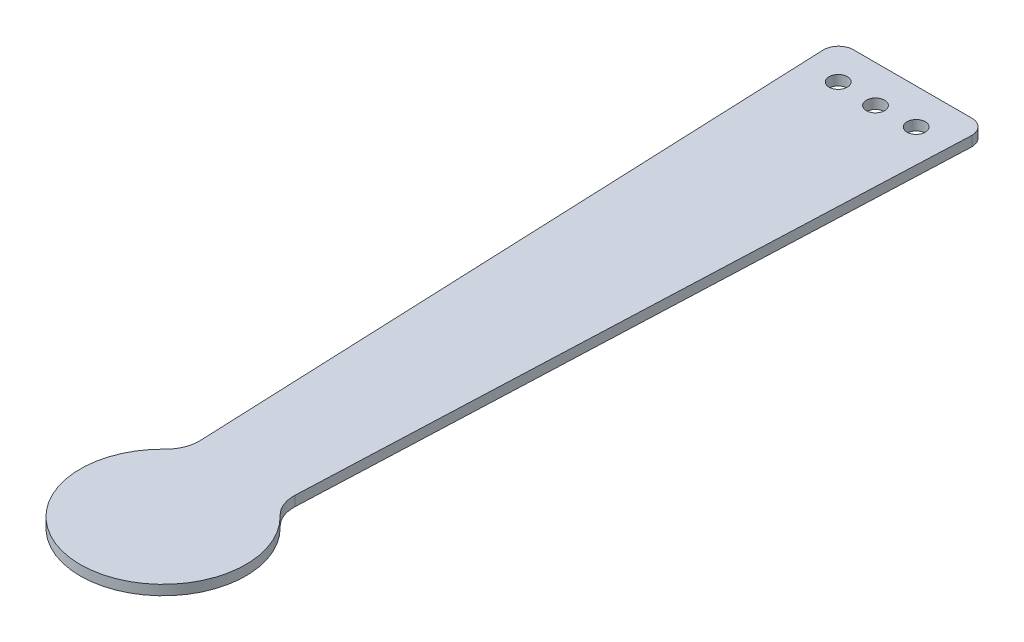
ISO-10303-21;
HEADER;
FILE_DESCRIPTION(('STEP AP214'),'2;1');
FILE_NAME('part.step','',(''),(''),'','','');
FILE_SCHEMA(('AUTOMOTIVE_DESIGN { 1 0 10303 214 1 1 1 1 }'));
ENDSEC;
DATA;
#1=APPLICATION_CONTEXT('core data for automotive mechanical design processes');
#2=APPLICATION_PROTOCOL_DEFINITION('international standard','automotive_design',2000,#1);
#3=PRODUCT_CONTEXT('',#1,'mechanical');
#4=PRODUCT('Part','Part','',(#3));
#5=PRODUCT_RELATED_PRODUCT_CATEGORY('part','',(#4));
#6=PRODUCT_DEFINITION_FORMATION('','',#4);
#7=PRODUCT_DEFINITION_CONTEXT('part definition',#1,'design');
#8=PRODUCT_DEFINITION('design','',#6,#7);
#9=PRODUCT_DEFINITION_SHAPE('','',#8);
#10=(LENGTH_UNIT() NAMED_UNIT(*) SI_UNIT(.MILLI.,.METRE.));
#11=(NAMED_UNIT(*) PLANE_ANGLE_UNIT() SI_UNIT($,.RADIAN.));
#12=(NAMED_UNIT(*) SI_UNIT($,.STERADIAN.) SOLID_ANGLE_UNIT());
#13=UNCERTAINTY_MEASURE_WITH_UNIT(LENGTH_MEASURE(1.E-05),#10,'distance_accuracy_value','');
#14=(GEOMETRIC_REPRESENTATION_CONTEXT(3) GLOBAL_UNCERTAINTY_ASSIGNED_CONTEXT((#13)) GLOBAL_UNIT_ASSIGNED_CONTEXT((#10,
#11,#12)) REPRESENTATION_CONTEXT('',''));
#15=CARTESIAN_POINT('',(0.,0.,0.));
#16=DIRECTION('',(0.,0.,1.));
#17=DIRECTION('',(1.,0.,0.));
#18=AXIS2_PLACEMENT_3D('',#15,#16,#17);
#19=CARTESIAN_POINT('',(0.,3.,0.));
#20=DIRECTION('',(0.,0.,-1.));
#21=DIRECTION('',(-1.,0.,0.));
#22=AXIS2_PLACEMENT_3D('',#19,#20,#21);
#23=PLANE('',#22);
#24=DIRECTION('',(1.,0.,0.));
#25=VECTOR('',#24,1.);
#26=CARTESIAN_POINT('',(0.,0.,0.));
#27=LINE('',#26,#25);
#28=CARTESIAN_POINT('',(-18.1651658032971,0.,0.));
#29=VERTEX_POINT('',#28);
#30=CARTESIAN_POINT('',(18.1651658032971,0.,0.));
#31=VERTEX_POINT('',#30);
#32=EDGE_CURVE('E137',#29,#31,#27,.T.);
#33=ORIENTED_EDGE('',*,*,#32,.F.);
#34=DIRECTION('',(0.,-1.,0.));
#35=VECTOR('',#34,1.);
#36=CARTESIAN_POINT('',(-18.1651658032971,3.,0.));
#37=LINE('',#36,#35);
#38=CARTESIAN_POINT('',(-18.1651658032971,3.,0.));
#39=VERTEX_POINT('',#38);
#40=EDGE_CURVE('E11',#39,#29,#37,.T.);
#41=ORIENTED_EDGE('',*,*,#40,.F.);
#42=DIRECTION('',(1.,0.,0.));
#43=VECTOR('',#42,1.);
#44=CARTESIAN_POINT('',(0.,3.,0.));
#45=LINE('',#44,#43);
#46=CARTESIAN_POINT('',(18.1651658032971,3.,0.));
#47=VERTEX_POINT('',#46);
#48=EDGE_CURVE('E315',#39,#47,#45,.T.);
#49=ORIENTED_EDGE('',*,*,#48,.T.);
#50=DIRECTION('',(0.,-1.,0.));
#51=VECTOR('',#50,1.);
#52=CARTESIAN_POINT('',(18.1651658032971,3.,0.));
#53=LINE('',#52,#51);
#54=EDGE_CURVE('E51',#47,#31,#53,.T.);
#55=ORIENTED_EDGE('',*,*,#54,.T.);
#56=EDGE_LOOP('',(#33,#41,#49,#55));
#57=FACE_BOUND('',#56,.T.);
#58=ADVANCED_FACE('F34',(#57),#23,.T.);
#59=CARTESIAN_POINT('',(-17.8359122712119,3.,4.52844895976158));
#60=DIRECTION('',(0.,-1.,0.));
#61=DIRECTION('',(0.,0.,-1.));
#62=AXIS2_PLACEMENT_3D('',#59,#60,#61);
#63=CYLINDRICAL_SURFACE('',#62,4.54040283119861);
#64=CARTESIAN_POINT('',(-17.8359122712119,0.,4.52844895976158));
#65=DIRECTION('',(0.,1.,0.));
#66=DIRECTION('',(0.,0.,1.));
#67=AXIS2_PLACEMENT_3D('',#64,#65,#66);
#68=CIRCLE('',#67,4.54040283119861);
#69=CARTESIAN_POINT('',(-22.3761927820387,0.,4.49512100508649));
#70=VERTEX_POINT('',#69);
#71=EDGE_CURVE('E139',#29,#70,#68,.T.);
#72=ORIENTED_EDGE('',*,*,#71,.T.);
#73=DIRECTION('',(0.,-1.,0.));
#74=VECTOR('',#73,1.);
#75=CARTESIAN_POINT('',(-22.3761927820387,3.,4.49512100508649));
#76=LINE('',#75,#74);
#77=CARTESIAN_POINT('',(-22.3761927820387,3.,4.49512100508649));
#78=VERTEX_POINT('',#77);
#79=EDGE_CURVE('E43',#78,#70,#76,.T.);
#80=ORIENTED_EDGE('',*,*,#79,.F.);
#81=CARTESIAN_POINT('',(-17.8359122712119,3.,4.52844895976158));
#82=DIRECTION('',(0.,1.,0.));
#83=DIRECTION('',(0.,0.,1.));
#84=AXIS2_PLACEMENT_3D('',#81,#82,#83);
#85=CIRCLE('',#84,4.54040283119861);
#86=EDGE_CURVE('E311',#39,#78,#85,.T.);
#87=ORIENTED_EDGE('',*,*,#86,.F.);
#88=ORIENTED_EDGE('',*,*,#40,.T.);
#89=EDGE_LOOP('',(#72,#80,#87,#88));
#90=FACE_BOUND('',#89,.T.);
#91=ADVANCED_FACE('F176',(#90),#63,.T.);
#92=CARTESIAN_POINT('',(-22.5231002104946,3.,0.927440250515866));
#93=DIRECTION('',(0.999153291942038,0.,-0.0411424258082687));
#94=DIRECTION('',(-0.0411424258082687,0.,-0.999153291942038));
#95=AXIS2_PLACEMENT_3D('',#92,#93,#94);
#96=PLANE('',#95);
#97=DIRECTION('',(0.0411424258082687,0.,0.999153291942038));
#98=VECTOR('',#97,1.);
#99=CARTESIAN_POINT('',(-22.5231002104946,0.,0.927440250515866));
#100=LINE('',#99,#98);
#101=CARTESIAN_POINT('',(-14.2953171916204,0.,200.741046939715));
#102=VERTEX_POINT('',#101);
#103=EDGE_CURVE('E142',#70,#102,#100,.T.);
#104=ORIENTED_EDGE('',*,*,#103,.T.);
#105=DIRECTION('',(0.,-1.,0.));
#106=VECTOR('',#105,1.);
#107=CARTESIAN_POINT('',(-14.2953171916204,3.,200.741046939715));
#108=LINE('',#107,#106);
#109=CARTESIAN_POINT('',(-14.2953171916204,3.,200.741046939715));
#110=VERTEX_POINT('',#109);
#111=EDGE_CURVE('E164',#110,#102,#108,.T.);
#112=ORIENTED_EDGE('',*,*,#111,.F.);
#113=DIRECTION('',(0.0411424258082687,0.,0.999153291942038));
#114=VECTOR('',#113,1.);
#115=CARTESIAN_POINT('',(-22.5231002104946,3.,0.927440250515866));
#116=LINE('',#115,#114);
#117=EDGE_CURVE('E172',#78,#110,#116,.T.);
#118=ORIENTED_EDGE('',*,*,#117,.F.);
#119=ORIENTED_EDGE('',*,*,#79,.T.);
#120=EDGE_LOOP('',(#104,#112,#118,#119));
#121=FACE_BOUND('',#120,.T.);
#122=ADVANCED_FACE('F169',(#121),#96,.F.);
#123=CARTESIAN_POINT('',(-24.2910706279305,3.,201.032445705146));
#124=DIRECTION('',(0.,-1.,0.));
#125=DIRECTION('',(0.,0.,-1.));
#126=AXIS2_PLACEMENT_3D('',#123,#124,#125);
#127=CYLINDRICAL_SURFACE('',#126,10.);
#128=CARTESIAN_POINT('',(-24.2910706279305,0.,201.032445705146));
#129=DIRECTION('',(0.,1.,0.));
#130=DIRECTION('',(0.,0.,1.));
#131=AXIS2_PLACEMENT_3D('',#128,#129,#130);
#132=CIRCLE('',#131,10.);
#133=CARTESIAN_POINT('',(-17.4001042917172,0.,208.279140327743));
#134=VERTEX_POINT('',#133);
#135=EDGE_CURVE('E145',#102,#134,#132,.F.);
#136=ORIENTED_EDGE('',*,*,#135,.T.);
#137=DIRECTION('',(0.,-1.,0.));
#138=VECTOR('',#137,1.);
#139=CARTESIAN_POINT('',(-17.4001042917172,3.,208.279140327743));
#140=LINE('',#139,#138);
#141=CARTESIAN_POINT('',(-17.4001042917172,3.,208.279140327743));
#142=VERTEX_POINT('',#141);
#143=EDGE_CURVE('E161',#142,#134,#140,.T.);
#144=ORIENTED_EDGE('',*,*,#143,.F.);
#145=CARTESIAN_POINT('',(-24.2910706279305,3.,201.032445705146));
#146=DIRECTION('',(0.,1.,0.));
#147=DIRECTION('',(0.,0.,1.));
#148=AXIS2_PLACEMENT_3D('',#145,#146,#147);
#149=CIRCLE('',#148,10.);
#150=EDGE_CURVE('E309',#110,#142,#149,.F.);
#151=ORIENTED_EDGE('',*,*,#150,.F.);
#152=ORIENTED_EDGE('',*,*,#111,.T.);
#153=EDGE_LOOP('',(#136,#144,#151,#152));
#154=FACE_BOUND('',#153,.T.);
#155=ADVANCED_FACE('F225',(#154),#127,.F.);
#156=CARTESIAN_POINT('',(0.,3.,226.218747892033));
#157=DIRECTION('',(0.,-1.,0.));
#158=DIRECTION('',(0.,0.,-1.));
#159=AXIS2_PLACEMENT_3D('',#156,#157,#158);
#160=CYLINDRICAL_SURFACE('',#159,24.9918616538136);
#161=CARTESIAN_POINT('',(0.,0.,226.218747892033));
#162=DIRECTION('',(0.,1.,0.));
#163=DIRECTION('',(0.,0.,1.));
#164=AXIS2_PLACEMENT_3D('',#161,#162,#163);
#165=CIRCLE('',#164,24.9918616538136);
#166=CARTESIAN_POINT('',(17.4001042917172,0.,208.279140327743));
#167=VERTEX_POINT('',#166);
#168=EDGE_CURVE('E148',#134,#167,#165,.T.);
#169=ORIENTED_EDGE('',*,*,#168,.T.);
#170=DIRECTION('',(0.,-1.,0.));
#171=VECTOR('',#170,1.);
#172=CARTESIAN_POINT('',(17.4001042917172,3.,208.279140327743));
#173=LINE('',#172,#171);
#174=CARTESIAN_POINT('',(17.4001042917172,3.,208.279140327743));
#175=VERTEX_POINT('',#174);
#176=EDGE_CURVE('E110',#175,#167,#173,.T.);
#177=ORIENTED_EDGE('',*,*,#176,.F.);
#178=CARTESIAN_POINT('',(0.,3.,226.218747892033));
#179=DIRECTION('',(0.,1.,0.));
#180=DIRECTION('',(0.,0.,1.));
#181=AXIS2_PLACEMENT_3D('',#178,#179,#180);
#182=CIRCLE('',#181,24.9918616538136);
#183=EDGE_CURVE('E119',#142,#175,#182,.T.);
#184=ORIENTED_EDGE('',*,*,#183,.F.);
#185=ORIENTED_EDGE('',*,*,#143,.T.);
#186=EDGE_LOOP('',(#169,#177,#184,#185));
#187=FACE_BOUND('',#186,.T.);
#188=ADVANCED_FACE('F222',(#187),#160,.T.);
#189=CARTESIAN_POINT('',(24.2910706279306,3.,201.032445705146));
#190=DIRECTION('',(0.,-1.,0.));
#191=DIRECTION('',(0.,0.,-1.));
#192=AXIS2_PLACEMENT_3D('',#189,#190,#191);
#193=CYLINDRICAL_SURFACE('',#192,10.);
#194=CARTESIAN_POINT('',(24.2910706279306,0.,201.032445705146));
#195=DIRECTION('',(0.,1.,0.));
#196=DIRECTION('',(0.,0.,1.));
#197=AXIS2_PLACEMENT_3D('',#194,#195,#196);
#198=CIRCLE('',#197,10.);
#199=CARTESIAN_POINT('',(14.2953171916205,0.,200.741046939715));
#200=VERTEX_POINT('',#199);
#201=EDGE_CURVE('E106',#200,#167,#198,.T.);
#202=ORIENTED_EDGE('',*,*,#201,.F.);
#203=DIRECTION('',(0.,-1.,0.));
#204=VECTOR('',#203,1.);
#205=CARTESIAN_POINT('',(14.2953171916205,3.,200.741046939715));
#206=LINE('',#205,#204);
#207=CARTESIAN_POINT('',(14.2953171916205,3.,200.741046939715));
#208=VERTEX_POINT('',#207);
#209=EDGE_CURVE('E101',#208,#200,#206,.T.);
#210=ORIENTED_EDGE('',*,*,#209,.F.);
#211=CARTESIAN_POINT('',(24.2910706279306,3.,201.032445705146));
#212=DIRECTION('',(0.,1.,0.));
#213=DIRECTION('',(0.,0.,1.));
#214=AXIS2_PLACEMENT_3D('',#211,#212,#213);
#215=CIRCLE('',#214,10.);
#216=EDGE_CURVE('E104',#208,#175,#215,.T.);
#217=ORIENTED_EDGE('',*,*,#216,.T.);
#218=ORIENTED_EDGE('',*,*,#176,.T.);
#219=EDGE_LOOP('',(#202,#210,#217,#218));
#220=FACE_BOUND('',#219,.T.);
#221=ADVANCED_FACE('F103',(#220),#193,.F.);
#222=CARTESIAN_POINT('',(22.5231002104946,3.,0.92744025051586));
#223=DIRECTION('',(0.999153291942038,0.,0.0411424258082684));
#224=DIRECTION('',(0.0411424258082684,0.,-0.999153291942038));
#225=AXIS2_PLACEMENT_3D('',#222,#223,#224);
#226=PLANE('',#225);
#227=DIRECTION('',(-0.0411424258082684,0.,0.999153291942038));
#228=VECTOR('',#227,1.);
#229=CARTESIAN_POINT('',(22.5231002104946,0.,0.92744025051586));
#230=LINE('',#229,#228);
#231=CARTESIAN_POINT('',(22.3761927820387,0.,4.49512100508649));
#232=VERTEX_POINT('',#231);
#233=EDGE_CURVE('E152',#232,#200,#230,.T.);
#234=ORIENTED_EDGE('',*,*,#233,.F.);
#235=DIRECTION('',(0.,-1.,0.));
#236=VECTOR('',#235,1.);
#237=CARTESIAN_POINT('',(22.3761927820387,3.,4.49512100508649));
#238=LINE('',#237,#236);
#239=CARTESIAN_POINT('',(22.3761927820387,3.,4.49512100508649));
#240=VERTEX_POINT('',#239);
#241=EDGE_CURVE('E76',#240,#232,#238,.T.);
#242=ORIENTED_EDGE('',*,*,#241,.F.);
#243=DIRECTION('',(-0.0411424258082684,0.,0.999153291942038));
#244=VECTOR('',#243,1.);
#245=CARTESIAN_POINT('',(22.5231002104946,3.,0.92744025051586));
#246=LINE('',#245,#244);
#247=EDGE_CURVE('E117',#240,#208,#246,.T.);
#248=ORIENTED_EDGE('',*,*,#247,.T.);
#249=ORIENTED_EDGE('',*,*,#209,.T.);
#250=EDGE_LOOP('',(#234,#242,#248,#249));
#251=FACE_BOUND('',#250,.T.);
#252=ADVANCED_FACE('F122',(#251),#226,.T.);
#253=CARTESIAN_POINT('',(11.7741636175718,3.,10.7050321395842));
#254=DIRECTION('',(0.,-1.,0.));
#255=DIRECTION('',(0.,0.,-1.));
#256=AXIS2_PLACEMENT_3D('',#253,#254,#255);
#257=CYLINDRICAL_SURFACE('',#256,2.75000000000002);
#258=CARTESIAN_POINT('',(11.7741636175718,3.,10.7050321395842));
#259=DIRECTION('',(0.,1.,0.));
#260=DIRECTION('',(0.,0.,1.));
#261=AXIS2_PLACEMENT_3D('',#258,#259,#260);
#262=CIRCLE('',#261,2.75000000000002);
#263=CARTESIAN_POINT('',(11.7741636175718,3.,13.4550321395842));
#264=VERTEX_POINT('',#263);
#265=EDGE_CURVE('E317',#264,#264,#262,.T.);
#266=ORIENTED_EDGE('',*,*,#265,.T.);
#267=EDGE_LOOP('',(#266));
#268=FACE_BOUND('',#267,.T.);
#269=CARTESIAN_POINT('',(11.7741636175718,0.,10.7050321395842));
#270=DIRECTION('',(0.,1.,0.));
#271=DIRECTION('',(0.,0.,1.));
#272=AXIS2_PLACEMENT_3D('',#269,#270,#271);
#273=CIRCLE('',#272,2.75000000000002);
#274=CARTESIAN_POINT('',(11.7741636175718,0.,13.4550321395842));
#275=VERTEX_POINT('',#274);
#276=EDGE_CURVE('E134',#275,#275,#273,.T.);
#277=ORIENTED_EDGE('',*,*,#276,.F.);
#278=EDGE_LOOP('',(#277));
#279=FACE_BOUND('',#278,.T.);
#280=ADVANCED_FACE('F187',(#268,#279),#257,.F.);
#281=CARTESIAN_POINT('',(0.00813834618595423,3.,11.2187478972181));
#282=DIRECTION('',(0.,-1.,0.));
#283=DIRECTION('',(0.,0.,-1.));
#284=AXIS2_PLACEMENT_3D('',#281,#282,#283);
#285=CYLINDRICAL_SURFACE('',#284,2.75000000000001);
#286=CARTESIAN_POINT('',(0.00813834618595423,3.,11.2187478972181));
#287=DIRECTION('',(0.,1.,0.));
#288=DIRECTION('',(0.,0.,1.));
#289=AXIS2_PLACEMENT_3D('',#286,#287,#288);
#290=CIRCLE('',#289,2.75000000000001);
#291=CARTESIAN_POINT('',(0.00813834618595423,3.,13.9687478972182));
#292=VERTEX_POINT('',#291);
#293=EDGE_CURVE('E201',#292,#292,#290,.T.);
#294=ORIENTED_EDGE('',*,*,#293,.T.);
#295=EDGE_LOOP('',(#294));
#296=FACE_BOUND('',#295,.T.);
#297=CARTESIAN_POINT('',(0.00813834618595423,0.,11.2187478972181));
#298=DIRECTION('',(0.,1.,0.));
#299=DIRECTION('',(0.,0.,1.));
#300=AXIS2_PLACEMENT_3D('',#297,#298,#299);
#301=CIRCLE('',#300,2.75000000000001);
#302=CARTESIAN_POINT('',(0.00813834618595423,0.,13.9687478972182));
#303=VERTEX_POINT('',#302);
#304=EDGE_CURVE('E131',#303,#303,#301,.T.);
#305=ORIENTED_EDGE('',*,*,#304,.F.);
#306=EDGE_LOOP('',(#305));
#307=FACE_BOUND('',#306,.T.);
#308=ADVANCED_FACE('F189',(#296,#307),#285,.F.);
#309=CARTESIAN_POINT('',(-11.7578869251998,3.,10.7050321395841));
#310=DIRECTION('',(0.,-1.,0.));
#311=DIRECTION('',(0.,0.,-1.));
#312=AXIS2_PLACEMENT_3D('',#309,#310,#311);
#313=CYLINDRICAL_SURFACE('',#312,2.75000000000001);
#314=CARTESIAN_POINT('',(-11.7578869251998,3.,10.7050321395841));
#315=DIRECTION('',(0.,1.,0.));
#316=DIRECTION('',(0.,0.,1.));
#317=AXIS2_PLACEMENT_3D('',#314,#315,#316);
#318=CIRCLE('',#317,2.75000000000001);
#319=CARTESIAN_POINT('',(-11.7578869251998,3.,13.4550321395841));
#320=VERTEX_POINT('',#319);
#321=EDGE_CURVE('E157',#320,#320,#318,.T.);
#322=ORIENTED_EDGE('',*,*,#321,.T.);
#323=EDGE_LOOP('',(#322));
#324=FACE_BOUND('',#323,.T.);
#325=CARTESIAN_POINT('',(-11.7578869251998,0.,10.7050321395841));
#326=DIRECTION('',(0.,1.,0.));
#327=DIRECTION('',(0.,0.,1.));
#328=AXIS2_PLACEMENT_3D('',#325,#326,#327);
#329=CIRCLE('',#328,2.75000000000001);
#330=CARTESIAN_POINT('',(-11.7578869251998,0.,13.4550321395841));
#331=VERTEX_POINT('',#330);
#332=EDGE_CURVE('E128',#331,#331,#329,.T.);
#333=ORIENTED_EDGE('',*,*,#332,.F.);
#334=EDGE_LOOP('',(#333));
#335=FACE_BOUND('',#334,.T.);
#336=ADVANCED_FACE('F36',(#324,#335),#313,.F.);
#337=CARTESIAN_POINT('',(17.8359122712119,3.,4.52844895976158));
#338=DIRECTION('',(0.,-1.,0.));
#339=DIRECTION('',(0.,0.,-1.));
#340=AXIS2_PLACEMENT_3D('',#337,#338,#339);
#341=CYLINDRICAL_SURFACE('',#340,4.54040283119861);
#342=CARTESIAN_POINT('',(17.8359122712119,0.,4.52844895976158));
#343=DIRECTION('',(0.,1.,0.));
#344=DIRECTION('',(0.,0.,1.));
#345=AXIS2_PLACEMENT_3D('',#342,#343,#344);
#346=CIRCLE('',#345,4.54040283119861);
#347=EDGE_CURVE('E154',#31,#232,#346,.F.);
#348=ORIENTED_EDGE('',*,*,#347,.F.);
#349=ORIENTED_EDGE('',*,*,#54,.F.);
#350=CARTESIAN_POINT('',(17.8359122712119,3.,4.52844895976158));
#351=DIRECTION('',(0.,1.,0.));
#352=DIRECTION('',(0.,0.,1.));
#353=AXIS2_PLACEMENT_3D('',#350,#351,#352);
#354=CIRCLE('',#353,4.54040283119861);
#355=EDGE_CURVE('E123',#47,#240,#354,.F.);
#356=ORIENTED_EDGE('',*,*,#355,.T.);
#357=ORIENTED_EDGE('',*,*,#241,.T.);
#358=EDGE_LOOP('',(#348,#349,#356,#357));
#359=FACE_BOUND('',#358,.T.);
#360=ADVANCED_FACE('F196',(#359),#341,.T.);
#361=CARTESIAN_POINT('',(0.,3.,0.));
#362=DIRECTION('',(0.,1.,0.));
#363=DIRECTION('',(0.,0.,1.));
#364=AXIS2_PLACEMENT_3D('',#361,#362,#363);
#365=PLANE('',#364);
#366=ORIENTED_EDGE('',*,*,#321,.F.);
#367=EDGE_LOOP('',(#366));
#368=FACE_BOUND('',#367,.T.);
#369=ORIENTED_EDGE('',*,*,#293,.F.);
#370=EDGE_LOOP('',(#369));
#371=FACE_BOUND('',#370,.T.);
#372=ORIENTED_EDGE('',*,*,#265,.F.);
#373=EDGE_LOOP('',(#372));
#374=FACE_BOUND('',#373,.T.);
#375=ORIENTED_EDGE('',*,*,#48,.F.);
#376=ORIENTED_EDGE('',*,*,#86,.T.);
#377=ORIENTED_EDGE('',*,*,#117,.T.);
#378=ORIENTED_EDGE('',*,*,#150,.T.);
#379=ORIENTED_EDGE('',*,*,#183,.T.);
#380=ORIENTED_EDGE('',*,*,#216,.F.);
#381=ORIENTED_EDGE('',*,*,#247,.F.);
#382=ORIENTED_EDGE('',*,*,#355,.F.);
#383=EDGE_LOOP('',(#375,#376,#377,#378,#379,#380,#381,#382));
#384=FACE_BOUND('',#383,.T.);
#385=ADVANCED_FACE('F115',(#368,#371,#374,#384),#365,.T.);
#386=CARTESIAN_POINT('',(0.,0.,0.));
#387=DIRECTION('',(0.,1.,0.));
#388=DIRECTION('',(0.,0.,1.));
#389=AXIS2_PLACEMENT_3D('',#386,#387,#388);
#390=PLANE('',#389);
#391=ORIENTED_EDGE('',*,*,#332,.T.);
#392=EDGE_LOOP('',(#391));
#393=FACE_BOUND('',#392,.T.);
#394=ORIENTED_EDGE('',*,*,#304,.T.);
#395=EDGE_LOOP('',(#394));
#396=FACE_BOUND('',#395,.T.);
#397=ORIENTED_EDGE('',*,*,#276,.T.);
#398=EDGE_LOOP('',(#397));
#399=FACE_BOUND('',#398,.T.);
#400=ORIENTED_EDGE('',*,*,#32,.T.);
#401=ORIENTED_EDGE('',*,*,#347,.T.);
#402=ORIENTED_EDGE('',*,*,#233,.T.);
#403=ORIENTED_EDGE('',*,*,#201,.T.);
#404=ORIENTED_EDGE('',*,*,#168,.F.);
#405=ORIENTED_EDGE('',*,*,#135,.F.);
#406=ORIENTED_EDGE('',*,*,#103,.F.);
#407=ORIENTED_EDGE('',*,*,#71,.F.);
#408=EDGE_LOOP('',(#400,#401,#402,#403,#404,#405,#406,#407));
#409=FACE_BOUND('',#408,.T.);
#410=ADVANCED_FACE('F178',(#393,#396,#399,#409),#390,.F.);
#411=CLOSED_SHELL('',(#58,#91,#122,#155,#188,#221,#252,#280,#308,#336,#360,#385,#410));
#412=MANIFOLD_SOLID_BREP('B2',#411);
#413=ADVANCED_BREP_SHAPE_REPRESENTATION('',(#18,#412),#14);
#414=SHAPE_DEFINITION_REPRESENTATION(#9,#413);
ENDSEC;
END-ISO-10303-21;
